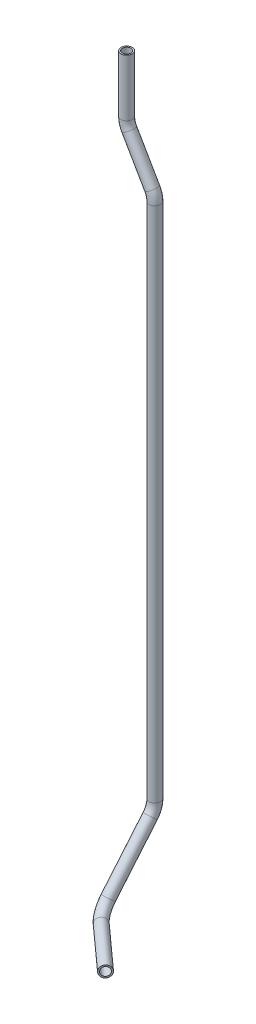
ISO-10303-21;
HEADER;
FILE_DESCRIPTION(('STEP AP214'),'2;1');
FILE_NAME('part.step','',(''),(''),'','','');
FILE_SCHEMA(('AUTOMOTIVE_DESIGN { 1 0 10303 214 1 1 1 1 }'));
ENDSEC;
DATA;
#1=APPLICATION_CONTEXT('core data for automotive mechanical design processes');
#2=APPLICATION_PROTOCOL_DEFINITION('international standard','automotive_design',2000,#1);
#3=PRODUCT_CONTEXT('',#1,'mechanical');
#4=PRODUCT('Part','Part','',(#3));
#5=PRODUCT_RELATED_PRODUCT_CATEGORY('part','',(#4));
#6=PRODUCT_DEFINITION_FORMATION('','',#4);
#7=PRODUCT_DEFINITION_CONTEXT('part definition',#1,'design');
#8=PRODUCT_DEFINITION('design','',#6,#7);
#9=PRODUCT_DEFINITION_SHAPE('','',#8);
#10=(LENGTH_UNIT() NAMED_UNIT(*) SI_UNIT(.MILLI.,.METRE.));
#11=(NAMED_UNIT(*) PLANE_ANGLE_UNIT() SI_UNIT($,.RADIAN.));
#12=(NAMED_UNIT(*) SI_UNIT($,.STERADIAN.) SOLID_ANGLE_UNIT());
#13=UNCERTAINTY_MEASURE_WITH_UNIT(LENGTH_MEASURE(1.E-05),#10,'distance_accuracy_value','');
#14=(GEOMETRIC_REPRESENTATION_CONTEXT(3) GLOBAL_UNCERTAINTY_ASSIGNED_CONTEXT((#13)) GLOBAL_UNIT_ASSIGNED_CONTEXT((#10,
#11,#12)) REPRESENTATION_CONTEXT('',''));
#15=CARTESIAN_POINT('',(0.,0.,0.));
#16=DIRECTION('',(0.,0.,1.));
#17=DIRECTION('',(1.,0.,0.));
#18=AXIS2_PLACEMENT_3D('',#15,#16,#17);
#19=CARTESIAN_POINT('',(39.8515406841542,-749.5,66.8703670745772));
#20=DIRECTION('',(0.743144825477396,0.,0.669130606358857));
#21=DIRECTION('',(0.669130606358857,0.,-0.743144825477395));
#22=AXIS2_PLACEMENT_3D('',#19,#20,#21);
#23=CYLINDRICAL_SURFACE('',#22,6.);
#24=CARTESIAN_POINT('',(39.8515406841542,-749.5,66.8703670745772));
#25=DIRECTION('',(-0.743144825477395,0.,-0.669130606358858));
#26=DIRECTION('',(-0.266360132155653,0.917355489473895,0.295822896223625));
#27=AXIS2_PLACEMENT_3D('',#24,#25,#26);
#28=CIRCLE('',#27,6.);
#29=CARTESIAN_POINT('',(37.7272076629011,-754.591253438935,69.2296779136457));
#30=VERTEX_POINT('',#29);
#31=EDGE_CURVE('E51',#30,#30,#28,.T.);
#32=ORIENTED_EDGE('',*,*,#31,.F.);
#33=EDGE_LOOP('',(#32));
#34=FACE_BOUND('',#33,.T.);
#35=CARTESIAN_POINT('',(86.0859319988743,-749.5,108.5));
#36=DIRECTION('',(-0.743144825477395,0.,-0.669130606358858));
#37=DIRECTION('',(-0.266360132155653,0.917355489473895,0.295822896223625));
#38=AXIS2_PLACEMENT_3D('',#35,#36,#37);
#39=CIRCLE('',#38,6.);
#40=CARTESIAN_POINT('',(84.4877712059404,-743.995867063157,110.274937377342));
#41=VERTEX_POINT('',#40);
#42=EDGE_CURVE('E10',#41,#41,#39,.T.);
#43=ORIENTED_EDGE('',*,*,#42,.T.);
#44=EDGE_LOOP('',(#43));
#45=FACE_BOUND('',#44,.T.);
#46=ADVANCED_FACE('F41',(#34,#45),#23,.T.);
#47=CARTESIAN_POINT('',(39.8515406841542,-749.5,66.8703670745772));
#48=DIRECTION('',(0.743144825477396,0.,0.669130606358857));
#49=DIRECTION('',(0.669130606358857,0.,-0.743144825477395));
#50=AXIS2_PLACEMENT_3D('',#47,#48,#49);
#51=CYLINDRICAL_SURFACE('',#50,4.5);
#52=CARTESIAN_POINT('',(39.8515406841542,-749.5,66.8703670745772));
#53=DIRECTION('',(-0.743144825477395,0.,-0.669130606358858));
#54=DIRECTION('',(-0.266360132155653,0.917355489473895,0.295822896223625));
#55=AXIS2_PLACEMENT_3D('',#52,#53,#54);
#56=CIRCLE('',#55,4.5);
#57=CARTESIAN_POINT('',(38.2582909182144,-753.318440079201,68.6398502038786));
#58=VERTEX_POINT('',#57);
#59=EDGE_CURVE('E55',#58,#58,#56,.T.);
#60=ORIENTED_EDGE('',*,*,#59,.T.);
#61=EDGE_LOOP('',(#60));
#62=FACE_BOUND('',#61,.T.);
#63=CARTESIAN_POINT('',(86.0859319988743,-749.5,108.5));
#64=DIRECTION('',(-0.743144825477395,0.,-0.669130606358858));
#65=DIRECTION('',(-0.266360132155653,0.917355489473895,0.295822896223625));
#66=AXIS2_PLACEMENT_3D('',#63,#64,#65);
#67=CIRCLE('',#66,4.5);
#68=CARTESIAN_POINT('',(84.8873114041739,-745.371900297368,109.831203033006));
#69=VERTEX_POINT('',#68);
#70=EDGE_CURVE('E47',#69,#69,#67,.T.);
#71=ORIENTED_EDGE('',*,*,#70,.F.);
#72=EDGE_LOOP('',(#71));
#73=FACE_BOUND('',#72,.T.);
#74=ADVANCED_FACE('F134',(#62,#73),#51,.F.);
#75=CARTESIAN_POINT('',(47.2867062585402,-731.680612963728,58.612779137837));
#76=DIRECTION('',(-0.567785583453527,0.529127647394301,0.630589774723084));
#77=DIRECTION('',(0.743144825477395,0.,0.669130606358857));
#78=AXIS2_PLACEMENT_3D('',#75,#76,#77);
#79=TOROIDAL_SURFACE('',#78,21.,6.);
#80=CARTESIAN_POINT('',(30.,-739.344889261782,49.4788503249965));
#81=DIRECTION('',(0.,0.766044443118979,-0.642787609686538));
#82=DIRECTION('',(0.,0.642787609686538,0.766044443118979));
#83=AXIS2_PLACEMENT_3D('',#80,#81,#82);
#84=CIRCLE('',#83,6.);
#85=CARTESIAN_POINT('',(25.0609410689886,-741.534682489797,46.8691563784707));
#86=VERTEX_POINT('',#85);
#87=EDGE_CURVE('E60',#86,#86,#84,.T.);
#88=CARTESIAN_POINT('',(47.2867062585402,-731.680612963728,58.612779137837));
#89=DIRECTION('',(-0.567785583453527,0.529127647394301,0.630589774723084));
#90=DIRECTION('',(0.743144825477395,0.,0.669130606358857));
#91=AXIS2_PLACEMENT_3D('',#88,#89,#90);
#92=CIRCLE('',#91,27.);
#93=EDGE_CURVE('',#86,#30,#92,.T.);
#94=ORIENTED_EDGE('',*,*,#87,.F.);
#95=ORIENTED_EDGE('',*,*,#31,.T.);
#96=ORIENTED_EDGE('',*,*,#93,.T.);
#97=ORIENTED_EDGE('',*,*,#93,.F.);
#98=EDGE_LOOP('',(#94,#96,#95,#97));
#99=FACE_BOUND('',#98,.T.);
#100=ADVANCED_FACE('F139',(#99),#79,.T.);
#101=CARTESIAN_POINT('',(47.2867062585402,-731.680612963728,58.612779137837));
#102=DIRECTION('',(-0.567785583453527,0.529127647394301,0.630589774723084));
#103=DIRECTION('',(0.743144825477395,0.,0.669130606358857));
#104=AXIS2_PLACEMENT_3D('',#101,#102,#103);
#105=TOROIDAL_SURFACE('',#104,21.,4.5);
#106=CARTESIAN_POINT('',(30.,-739.344889261782,49.4788503249965));
#107=DIRECTION('',(0.,0.766044443118979,-0.642787609686538));
#108=DIRECTION('',(0.,0.642787609686538,0.766044443118979));
#109=AXIS2_PLACEMENT_3D('',#106,#107,#108);
#110=CIRCLE('',#109,4.5);
#111=CARTESIAN_POINT('',(26.2957058017414,-740.987234182793,47.5215798651021));
#112=VERTEX_POINT('',#111);
#113=EDGE_CURVE('E63',#112,#112,#110,.T.);
#114=CARTESIAN_POINT('',(47.2867062585402,-731.680612963728,58.612779137837));
#115=DIRECTION('',(-0.567785583453527,0.529127647394301,0.630589774723084));
#116=DIRECTION('',(0.743144825477395,0.,0.669130606358857));
#117=AXIS2_PLACEMENT_3D('',#114,#115,#116);
#118=CIRCLE('',#117,25.5);
#119=EDGE_CURVE('',#112,#58,#118,.T.);
#120=ORIENTED_EDGE('',*,*,#113,.T.);
#121=ORIENTED_EDGE('',*,*,#59,.F.);
#122=ORIENTED_EDGE('',*,*,#119,.T.);
#123=ORIENTED_EDGE('',*,*,#119,.F.);
#124=EDGE_LOOP('',(#120,#122,#121,#123));
#125=FACE_BOUND('',#124,.T.);
#126=ADVANCED_FACE('F144',(#125),#105,.F.);
#127=CARTESIAN_POINT('',(30.,-686.233456513363,4.91306669450142));
#128=DIRECTION('',(0.,-0.766044443118979,0.642787609686538));
#129=DIRECTION('',(0.,-0.642787609686538,-0.766044443118979));
#130=AXIS2_PLACEMENT_3D('',#127,#128,#129);
#131=CYLINDRICAL_SURFACE('',#130,6.);
#132=CARTESIAN_POINT('',(30.,-686.233456513363,4.91306669450142));
#133=DIRECTION('',(0.,0.766044443118979,-0.642787609686538));
#134=DIRECTION('',(0.,0.642787609686538,0.766044443118979));
#135=AXIS2_PLACEMENT_3D('',#132,#133,#134);
#136=CIRCLE('',#135,6.);
#137=CARTESIAN_POINT('',(30.,-690.090182171482,0.316800035787556));
#138=VERTEX_POINT('',#137);
#139=EDGE_CURVE('E66',#138,#138,#136,.T.);
#140=ORIENTED_EDGE('',*,*,#139,.F.);
#141=EDGE_LOOP('',(#140));
#142=FACE_BOUND('',#141,.T.);
#143=ORIENTED_EDGE('',*,*,#87,.T.);
#144=EDGE_LOOP('',(#143));
#145=FACE_BOUND('',#144,.T.);
#146=ADVANCED_FACE('F150',(#142,#145),#131,.T.);
#147=CARTESIAN_POINT('',(30.,-686.233456513363,4.91306669450142));
#148=DIRECTION('',(0.,-0.766044443118979,0.642787609686538));
#149=DIRECTION('',(0.,-0.642787609686538,-0.766044443118979));
#150=AXIS2_PLACEMENT_3D('',#147,#148,#149);
#151=CYLINDRICAL_SURFACE('',#150,4.5);
#152=CARTESIAN_POINT('',(30.,-686.233456513363,4.91306669450142));
#153=DIRECTION('',(0.,0.766044443118979,-0.642787609686538));
#154=DIRECTION('',(0.,0.642787609686538,0.766044443118979));
#155=AXIS2_PLACEMENT_3D('',#152,#153,#154);
#156=CIRCLE('',#155,4.5);
#157=CARTESIAN_POINT('',(30.,-689.126000756952,1.46586670046603));
#158=VERTEX_POINT('',#157);
#159=EDGE_CURVE('E69',#158,#158,#156,.T.);
#160=ORIENTED_EDGE('',*,*,#159,.T.);
#161=EDGE_LOOP('',(#160));
#162=FACE_BOUND('',#161,.T.);
#163=ORIENTED_EDGE('',*,*,#113,.F.);
#164=EDGE_LOOP('',(#163));
#165=FACE_BOUND('',#164,.T.);
#166=ADVANCED_FACE('F157',(#162,#165),#151,.F.);
#167=CARTESIAN_POINT('',(30.,-672.734916709945,21.));
#168=DIRECTION('',(-1.,0.,0.));
#169=DIRECTION('',(0.,0.,1.));
#170=AXIS2_PLACEMENT_3D('',#167,#168,#169);
#171=TOROIDAL_SURFACE('',#170,21.,6.);
#172=CARTESIAN_POINT('',(30.,-672.734916709945,0.));
#173=DIRECTION('',(0.,1.,0.));
#174=DIRECTION('',(0.,0.,1.));
#175=AXIS2_PLACEMENT_3D('',#172,#173,#174);
#176=CIRCLE('',#175,6.);
#177=CARTESIAN_POINT('',(30.,-672.734916709945,-6.));
#178=VERTEX_POINT('',#177);
#179=EDGE_CURVE('E72',#178,#178,#176,.T.);
#180=CARTESIAN_POINT('',(30.,-672.734916709945,21.));
#181=DIRECTION('',(-1.,0.,0.));
#182=DIRECTION('',(0.,0.,1.));
#183=AXIS2_PLACEMENT_3D('',#180,#181,#182);
#184=CIRCLE('',#183,27.);
#185=EDGE_CURVE('',#178,#138,#184,.T.);
#186=ORIENTED_EDGE('',*,*,#179,.F.);
#187=ORIENTED_EDGE('',*,*,#139,.T.);
#188=ORIENTED_EDGE('',*,*,#185,.T.);
#189=ORIENTED_EDGE('',*,*,#185,.F.);
#190=EDGE_LOOP('',(#186,#188,#187,#189));
#191=FACE_BOUND('',#190,.T.);
#192=ADVANCED_FACE('F161',(#191),#171,.T.);
#193=CARTESIAN_POINT('',(30.,-672.734916709945,21.));
#194=DIRECTION('',(-1.,0.,0.));
#195=DIRECTION('',(0.,0.,1.));
#196=AXIS2_PLACEMENT_3D('',#193,#194,#195);
#197=TOROIDAL_SURFACE('',#196,21.,4.5);
#198=CARTESIAN_POINT('',(30.,-672.734916709945,0.));
#199=DIRECTION('',(0.,1.,0.));
#200=DIRECTION('',(0.,0.,1.));
#201=AXIS2_PLACEMENT_3D('',#198,#199,#200);
#202=CIRCLE('',#201,4.5);
#203=CARTESIAN_POINT('',(30.,-672.734916709945,-4.5));
#204=VERTEX_POINT('',#203);
#205=EDGE_CURVE('E75',#204,#204,#202,.T.);
#206=CARTESIAN_POINT('',(30.,-672.734916709945,21.));
#207=DIRECTION('',(-1.,0.,0.));
#208=DIRECTION('',(0.,0.,1.));
#209=AXIS2_PLACEMENT_3D('',#206,#207,#208);
#210=CIRCLE('',#209,25.5);
#211=EDGE_CURVE('',#204,#158,#210,.T.);
#212=ORIENTED_EDGE('',*,*,#205,.T.);
#213=ORIENTED_EDGE('',*,*,#159,.F.);
#214=ORIENTED_EDGE('',*,*,#211,.T.);
#215=ORIENTED_EDGE('',*,*,#211,.F.);
#216=EDGE_LOOP('',(#212,#214,#213,#215));
#217=FACE_BOUND('',#216,.T.);
#218=ADVANCED_FACE('F165',(#217),#197,.F.);
#219=CARTESIAN_POINT('',(30.,-123.58845726812,0.));
#220=DIRECTION('',(0.,-1.,0.));
#221=DIRECTION('',(1.,0.,0.));
#222=AXIS2_PLACEMENT_3D('',#219,#220,#221);
#223=CYLINDRICAL_SURFACE('',#222,6.);
#224=CARTESIAN_POINT('',(30.,-123.58845726812,0.));
#225=DIRECTION('',(0.,1.,0.));
#226=DIRECTION('',(0.,0.,1.));
#227=AXIS2_PLACEMENT_3D('',#224,#225,#226);
#228=CIRCLE('',#227,6.);
#229=CARTESIAN_POINT('',(36.,-123.58845726812,0.));
#230=VERTEX_POINT('',#229);
#231=EDGE_CURVE('E78',#230,#230,#228,.T.);
#232=ORIENTED_EDGE('',*,*,#231,.F.);
#233=EDGE_LOOP('',(#232));
#234=FACE_BOUND('',#233,.T.);
#235=ORIENTED_EDGE('',*,*,#179,.T.);
#236=EDGE_LOOP('',(#235));
#237=FACE_BOUND('',#236,.T.);
#238=ADVANCED_FACE('F169',(#234,#237),#223,.T.);
#239=CARTESIAN_POINT('',(30.,-123.58845726812,0.));
#240=DIRECTION('',(0.,-1.,0.));
#241=DIRECTION('',(1.,0.,0.));
#242=AXIS2_PLACEMENT_3D('',#239,#240,#241);
#243=CYLINDRICAL_SURFACE('',#242,4.5);
#244=CARTESIAN_POINT('',(30.,-123.58845726812,0.));
#245=DIRECTION('',(0.,1.,0.));
#246=DIRECTION('',(0.,0.,1.));
#247=AXIS2_PLACEMENT_3D('',#244,#245,#246);
#248=CIRCLE('',#247,4.5);
#249=CARTESIAN_POINT('',(34.5,-123.58845726812,0.));
#250=VERTEX_POINT('',#249);
#251=EDGE_CURVE('E81',#250,#250,#248,.T.);
#252=ORIENTED_EDGE('',*,*,#251,.T.);
#253=EDGE_LOOP('',(#252));
#254=FACE_BOUND('',#253,.T.);
#255=ORIENTED_EDGE('',*,*,#205,.F.);
#256=EDGE_LOOP('',(#255));
#257=FACE_BOUND('',#256,.T.);
#258=ADVANCED_FACE('F173',(#254,#257),#243,.F.);
#259=CARTESIAN_POINT('',(9.,-123.58845726812,0.));
#260=DIRECTION('',(0.,0.,-1.));
#261=DIRECTION('',(-1.,0.,0.));
#262=AXIS2_PLACEMENT_3D('',#259,#260,#261);
#263=TOROIDAL_SURFACE('',#262,21.,6.);
#264=CARTESIAN_POINT('',(27.1865334794732,-113.08845726812,0.));
#265=DIRECTION('',(-0.500000000000001,0.866025403784438,0.));
#266=DIRECTION('',(0.,0.,1.));
#267=AXIS2_PLACEMENT_3D('',#264,#265,#266);
#268=CIRCLE('',#267,6.);
#269=CARTESIAN_POINT('',(32.3826859021798,-110.08845726812,0.));
#270=VERTEX_POINT('',#269);
#271=EDGE_CURVE('E84',#270,#270,#268,.T.);
#272=CARTESIAN_POINT('',(9.,-123.58845726812,0.));
#273=DIRECTION('',(0.,0.,-1.));
#274=DIRECTION('',(-1.,0.,0.));
#275=AXIS2_PLACEMENT_3D('',#272,#273,#274);
#276=CIRCLE('',#275,27.);
#277=EDGE_CURVE('',#270,#230,#276,.T.);
#278=ORIENTED_EDGE('',*,*,#271,.F.);
#279=ORIENTED_EDGE('',*,*,#231,.T.);
#280=ORIENTED_EDGE('',*,*,#277,.T.);
#281=ORIENTED_EDGE('',*,*,#277,.F.);
#282=EDGE_LOOP('',(#278,#280,#279,#281));
#283=FACE_BOUND('',#282,.T.);
#284=ADVANCED_FACE('F177',(#283),#263,.T.);
#285=CARTESIAN_POINT('',(9.,-123.58845726812,0.));
#286=DIRECTION('',(0.,0.,-1.));
#287=DIRECTION('',(-1.,0.,0.));
#288=AXIS2_PLACEMENT_3D('',#285,#286,#287);
#289=TOROIDAL_SURFACE('',#288,21.,4.5);
#290=CARTESIAN_POINT('',(27.1865334794732,-113.08845726812,0.));
#291=DIRECTION('',(-0.500000000000001,0.866025403784438,0.));
#292=DIRECTION('',(0.,0.,1.));
#293=AXIS2_PLACEMENT_3D('',#290,#291,#292);
#294=CIRCLE('',#293,4.5);
#295=CARTESIAN_POINT('',(31.0836477965032,-110.83845726812,0.));
#296=VERTEX_POINT('',#295);
#297=EDGE_CURVE('E87',#296,#296,#294,.T.);
#298=CARTESIAN_POINT('',(9.,-123.58845726812,0.));
#299=DIRECTION('',(0.,0.,-1.));
#300=DIRECTION('',(-1.,0.,0.));
#301=AXIS2_PLACEMENT_3D('',#298,#299,#300);
#302=CIRCLE('',#301,25.5);
#303=EDGE_CURVE('',#296,#250,#302,.T.);
#304=ORIENTED_EDGE('',*,*,#297,.T.);
#305=ORIENTED_EDGE('',*,*,#251,.F.);
#306=ORIENTED_EDGE('',*,*,#303,.T.);
#307=ORIENTED_EDGE('',*,*,#303,.F.);
#308=EDGE_LOOP('',(#304,#306,#305,#307));
#309=FACE_BOUND('',#308,.T.);
#310=ADVANCED_FACE('F181',(#309),#289,.F.);
#311=CARTESIAN_POINT('',(2.8134665205268,-70.8730669589464,0.));
#312=DIRECTION('',(0.500000000000001,-0.866025403784438,0.));
#313=DIRECTION('',(0.866025403784438,0.500000000000001,0.));
#314=AXIS2_PLACEMENT_3D('',#311,#312,#313);
#315=CYLINDRICAL_SURFACE('',#314,6.);
#316=CARTESIAN_POINT('',(2.8134665205268,-70.8730669589464,0.));
#317=DIRECTION('',(-0.500000000000001,0.866025403784438,0.));
#318=DIRECTION('',(0.,0.,1.));
#319=AXIS2_PLACEMENT_3D('',#316,#317,#318);
#320=CIRCLE('',#319,6.);
#321=CARTESIAN_POINT('',(-2.38268590217983,-73.8730669589464,0.));
#322=VERTEX_POINT('',#321);
#323=EDGE_CURVE('E90',#322,#322,#320,.T.);
#324=ORIENTED_EDGE('',*,*,#323,.F.);
#325=EDGE_LOOP('',(#324));
#326=FACE_BOUND('',#325,.T.);
#327=ORIENTED_EDGE('',*,*,#271,.T.);
#328=EDGE_LOOP('',(#327));
#329=FACE_BOUND('',#328,.T.);
#330=ADVANCED_FACE('F185',(#326,#329),#315,.T.);
#331=CARTESIAN_POINT('',(2.8134665205268,-70.8730669589464,0.));
#332=DIRECTION('',(0.500000000000001,-0.866025403784438,0.));
#333=DIRECTION('',(0.866025403784438,0.500000000000001,0.));
#334=AXIS2_PLACEMENT_3D('',#331,#332,#333);
#335=CYLINDRICAL_SURFACE('',#334,4.5);
#336=CARTESIAN_POINT('',(2.8134665205268,-70.8730669589464,0.));
#337=DIRECTION('',(-0.500000000000001,0.866025403784438,0.));
#338=DIRECTION('',(0.,0.,1.));
#339=AXIS2_PLACEMENT_3D('',#336,#337,#338);
#340=CIRCLE('',#339,4.5);
#341=CARTESIAN_POINT('',(-1.08364779650317,-73.1230669589464,0.));
#342=VERTEX_POINT('',#341);
#343=EDGE_CURVE('E93',#342,#342,#340,.T.);
#344=ORIENTED_EDGE('',*,*,#343,.T.);
#345=EDGE_LOOP('',(#344));
#346=FACE_BOUND('',#345,.T.);
#347=ORIENTED_EDGE('',*,*,#297,.F.);
#348=EDGE_LOOP('',(#347));
#349=FACE_BOUND('',#348,.T.);
#350=ADVANCED_FACE('F189',(#346,#349),#335,.F.);
#351=CARTESIAN_POINT('',(21.,-60.3730669589464,0.));
#352=DIRECTION('',(0.,0.,1.));
#353=DIRECTION('',(1.,0.,0.));
#354=AXIS2_PLACEMENT_3D('',#351,#352,#353);
#355=TOROIDAL_SURFACE('',#354,21.,6.);
#356=CARTESIAN_POINT('',(0.,-60.3730669589464,0.));
#357=DIRECTION('',(0.,1.,0.));
#358=DIRECTION('',(0.,0.,1.));
#359=AXIS2_PLACEMENT_3D('',#356,#357,#358);
#360=CIRCLE('',#359,6.);
#361=CARTESIAN_POINT('',(-6.,-60.3730669589464,0.));
#362=VERTEX_POINT('',#361);
#363=EDGE_CURVE('E96',#362,#362,#360,.T.);
#364=CARTESIAN_POINT('',(21.,-60.3730669589464,0.));
#365=DIRECTION('',(0.,0.,1.));
#366=DIRECTION('',(1.,0.,0.));
#367=AXIS2_PLACEMENT_3D('',#364,#365,#366);
#368=CIRCLE('',#367,27.);
#369=EDGE_CURVE('',#362,#322,#368,.T.);
#370=ORIENTED_EDGE('',*,*,#363,.F.);
#371=ORIENTED_EDGE('',*,*,#323,.T.);
#372=ORIENTED_EDGE('',*,*,#369,.T.);
#373=ORIENTED_EDGE('',*,*,#369,.F.);
#374=EDGE_LOOP('',(#370,#372,#371,#373));
#375=FACE_BOUND('',#374,.T.);
#376=ADVANCED_FACE('F193',(#375),#355,.T.);
#377=CARTESIAN_POINT('',(21.,-60.3730669589464,0.));
#378=DIRECTION('',(0.,0.,1.));
#379=DIRECTION('',(1.,0.,0.));
#380=AXIS2_PLACEMENT_3D('',#377,#378,#379);
#381=TOROIDAL_SURFACE('',#380,21.,4.5);
#382=CARTESIAN_POINT('',(0.,-60.3730669589464,0.));
#383=DIRECTION('',(0.,1.,0.));
#384=DIRECTION('',(0.,0.,1.));
#385=AXIS2_PLACEMENT_3D('',#382,#383,#384);
#386=CIRCLE('',#385,4.5);
#387=CARTESIAN_POINT('',(-4.5,-60.3730669589464,0.));
#388=VERTEX_POINT('',#387);
#389=EDGE_CURVE('E100',#388,#388,#386,.T.);
#390=CARTESIAN_POINT('',(21.,-60.3730669589464,0.));
#391=DIRECTION('',(0.,0.,1.));
#392=DIRECTION('',(1.,0.,0.));
#393=AXIS2_PLACEMENT_3D('',#390,#391,#392);
#394=CIRCLE('',#393,25.5);
#395=EDGE_CURVE('',#388,#342,#394,.T.);
#396=ORIENTED_EDGE('',*,*,#389,.T.);
#397=ORIENTED_EDGE('',*,*,#343,.F.);
#398=ORIENTED_EDGE('',*,*,#395,.T.);
#399=ORIENTED_EDGE('',*,*,#395,.F.);
#400=EDGE_LOOP('',(#396,#398,#397,#399));
#401=FACE_BOUND('',#400,.T.);
#402=ADVANCED_FACE('F109',(#401),#381,.F.);
#403=CARTESIAN_POINT('',(0.,-60.3730669589464,0.));
#404=DIRECTION('',(0.,1.,0.));
#405=DIRECTION('',(0.,0.,1.));
#406=AXIS2_PLACEMENT_3D('',#403,#404,#405);
#407=CYLINDRICAL_SURFACE('',#406,4.5);
#408=ORIENTED_EDGE('',*,*,#389,.F.);
#409=EDGE_LOOP('',(#408));
#410=FACE_BOUND('',#409,.T.);
#411=CARTESIAN_POINT('',(0.,0.,0.));
#412=DIRECTION('',(0.,1.,0.));
#413=DIRECTION('',(0.,0.,1.));
#414=AXIS2_PLACEMENT_3D('',#411,#412,#413);
#415=CIRCLE('',#414,4.5);
#416=CARTESIAN_POINT('',(0.,0.,4.5));
#417=VERTEX_POINT('',#416);
#418=EDGE_CURVE('E101',#417,#417,#415,.T.);
#419=ORIENTED_EDGE('',*,*,#418,.T.);
#420=EDGE_LOOP('',(#419));
#421=FACE_BOUND('',#420,.T.);
#422=ADVANCED_FACE('F112',(#410,#421),#407,.F.);
#423=CARTESIAN_POINT('',(0.,-60.3730669589464,0.));
#424=DIRECTION('',(0.,1.,0.));
#425=DIRECTION('',(0.,0.,1.));
#426=AXIS2_PLACEMENT_3D('',#423,#424,#425);
#427=CYLINDRICAL_SURFACE('',#426,6.);
#428=ORIENTED_EDGE('',*,*,#363,.T.);
#429=EDGE_LOOP('',(#428));
#430=FACE_BOUND('',#429,.T.);
#431=CARTESIAN_POINT('',(0.,0.,0.));
#432=DIRECTION('',(0.,1.,0.));
#433=DIRECTION('',(0.,0.,1.));
#434=AXIS2_PLACEMENT_3D('',#431,#432,#433);
#435=CIRCLE('',#434,6.);
#436=CARTESIAN_POINT('',(0.,0.,6.));
#437=VERTEX_POINT('',#436);
#438=EDGE_CURVE('E97',#437,#437,#435,.T.);
#439=ORIENTED_EDGE('',*,*,#438,.F.);
#440=EDGE_LOOP('',(#439));
#441=FACE_BOUND('',#440,.T.);
#442=ADVANCED_FACE('F115',(#430,#441),#427,.T.);
#443=CARTESIAN_POINT('',(86.0859319988743,-749.5,108.5));
#444=DIRECTION('',(-0.743144825477395,0.,-0.669130606358858));
#445=DIRECTION('',(-0.266360132155653,0.917355489473895,0.295822896223625));
#446=AXIS2_PLACEMENT_3D('',#443,#444,#445);
#447=PLANE('',#446);
#448=ORIENTED_EDGE('',*,*,#70,.T.);
#449=EDGE_LOOP('',(#448));
#450=FACE_BOUND('',#449,.T.);
#451=ORIENTED_EDGE('',*,*,#42,.F.);
#452=EDGE_LOOP('',(#451));
#453=FACE_BOUND('',#452,.T.);
#454=ADVANCED_FACE('F122',(#450,#453),#447,.F.);
#455=CARTESIAN_POINT('',(0.,0.,0.));
#456=DIRECTION('',(0.,1.,0.));
#457=DIRECTION('',(0.,0.,1.));
#458=AXIS2_PLACEMENT_3D('',#455,#456,#457);
#459=PLANE('',#458);
#460=ORIENTED_EDGE('',*,*,#418,.F.);
#461=EDGE_LOOP('',(#460));
#462=FACE_BOUND('',#461,.T.);
#463=ORIENTED_EDGE('',*,*,#438,.T.);
#464=EDGE_LOOP('',(#463));
#465=FACE_BOUND('',#464,.T.);
#466=ADVANCED_FACE('F119',(#462,#465),#459,.T.);
#467=CLOSED_SHELL('',(#46,#74,#100,#126,#146,#166,#192,#218,#238,#258,#284,#310,#330,#350,#376,
#402,#422,#442,#454,#466));
#468=MANIFOLD_SOLID_BREP('B2',#467);
#469=ADVANCED_BREP_SHAPE_REPRESENTATION('',(#18,#468),#14);
#470=SHAPE_DEFINITION_REPRESENTATION(#9,#469);
ENDSEC;
END-ISO-10303-21;
